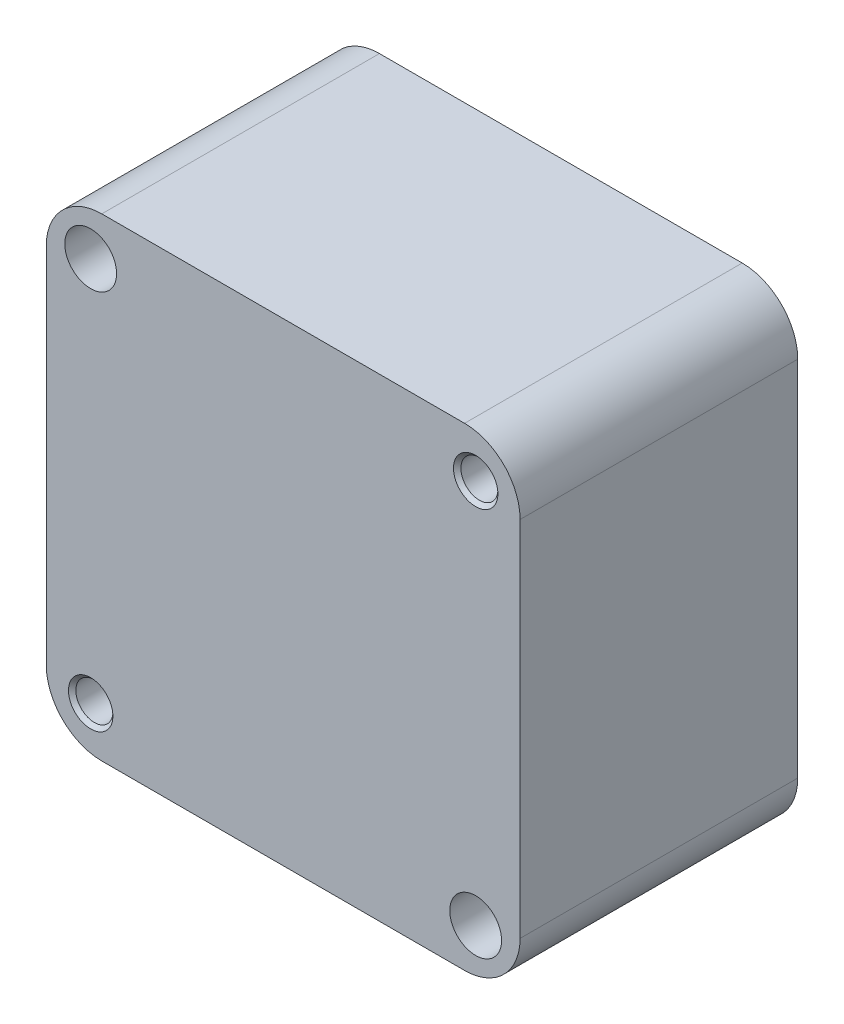
ISO-10303-21;
HEADER;
FILE_DESCRIPTION(('STEP AP214'),'2;1');
FILE_NAME('part.step','',(''),(''),'','','');
FILE_SCHEMA(('AUTOMOTIVE_DESIGN { 1 0 10303 214 1 1 1 1 }'));
ENDSEC;
DATA;
#1=APPLICATION_CONTEXT('core data for automotive mechanical design processes');
#2=APPLICATION_PROTOCOL_DEFINITION('international standard','automotive_design',2000,#1);
#3=PRODUCT_CONTEXT('',#1,'mechanical');
#4=PRODUCT('Part','Part','',(#3));
#5=PRODUCT_RELATED_PRODUCT_CATEGORY('part','',(#4));
#6=PRODUCT_DEFINITION_FORMATION('','',#4);
#7=PRODUCT_DEFINITION_CONTEXT('part definition',#1,'design');
#8=PRODUCT_DEFINITION('design','',#6,#7);
#9=PRODUCT_DEFINITION_SHAPE('','',#8);
#10=(LENGTH_UNIT() NAMED_UNIT(*) SI_UNIT(.MILLI.,.METRE.));
#11=(NAMED_UNIT(*) PLANE_ANGLE_UNIT() SI_UNIT($,.RADIAN.));
#12=(NAMED_UNIT(*) SI_UNIT($,.STERADIAN.) SOLID_ANGLE_UNIT());
#13=UNCERTAINTY_MEASURE_WITH_UNIT(LENGTH_MEASURE(1.E-05),#10,'distance_accuracy_value','');
#14=(GEOMETRIC_REPRESENTATION_CONTEXT(3) GLOBAL_UNCERTAINTY_ASSIGNED_CONTEXT((#13)) GLOBAL_UNIT_ASSIGNED_CONTEXT((#10,
#11,#12)) REPRESENTATION_CONTEXT('',''));
#15=CARTESIAN_POINT('',(0.,0.,0.));
#16=DIRECTION('',(0.,0.,1.));
#17=DIRECTION('',(1.,0.,0.));
#18=AXIS2_PLACEMENT_3D('',#15,#16,#17);
#19=CARTESIAN_POINT('',(52.,52.,17.5000000039063));
#20=DIRECTION('',(0.,0.,1.));
#21=DIRECTION('',(1.,0.,0.));
#22=AXIS2_PLACEMENT_3D('',#19,#20,#21);
#23=CONICAL_SURFACE('',#22,5.00499999767319,1.04719755000224);
#24=CARTESIAN_POINT('',(52.,52.0000000001062,14.6103618999973));
#25=VERTEX_POINT('',#24);
#26=VERTEX_LOOP('',#25);
#27=FACE_BOUND('',#26,.T.);
#28=CARTESIAN_POINT('',(52.,52.,17.5));
#29=DIRECTION('',(0.,0.,1.));
#30=DIRECTION('',(1.,0.,0.));
#31=AXIS2_PLACEMENT_3D('',#28,#29,#30);
#32=CIRCLE('',#31,5.005);
#33=CARTESIAN_POINT('',(57.005,52.,17.5));
#34=VERTEX_POINT('',#33);
#35=EDGE_CURVE('E103',#34,#34,#32,.T.);
#36=ORIENTED_EDGE('',*,*,#35,.T.);
#37=EDGE_LOOP('',(#36));
#38=FACE_BOUND('',#37,.T.);
#39=ADVANCED_FACE('F17',(#27,#38),#23,.F.);
#40=CARTESIAN_POINT('',(-52.,-52.,17.5000000039063));
#41=DIRECTION('',(0.,0.,1.));
#42=DIRECTION('',(1.,0.,0.));
#43=AXIS2_PLACEMENT_3D('',#40,#41,#42);
#44=CONICAL_SURFACE('',#43,5.00499999780189,1.04719754999504);
#45=CARTESIAN_POINT('',(-52.,-51.9999999999925,14.6103618998836));
#46=VERTEX_POINT('',#45);
#47=VERTEX_LOOP('',#46);
#48=FACE_BOUND('',#47,.T.);
#49=CARTESIAN_POINT('',(-52.,-52.,17.5));
#50=DIRECTION('',(0.,0.,1.));
#51=DIRECTION('',(1.,0.,0.));
#52=AXIS2_PLACEMENT_3D('',#49,#50,#51);
#53=CIRCLE('',#52,5.005);
#54=CARTESIAN_POINT('',(-46.995,-52.,17.5));
#55=VERTEX_POINT('',#54);
#56=EDGE_CURVE('E105',#55,#55,#53,.T.);
#57=ORIENTED_EDGE('',*,*,#56,.T.);
#58=EDGE_LOOP('',(#57));
#59=FACE_BOUND('',#58,.T.);
#60=ADVANCED_FACE('F100',(#48,#59),#44,.F.);
#61=CARTESIAN_POINT('',(0.,-44.0000000037912,-22.5));
#62=DIRECTION('',(0.,-1.,0.));
#63=DIRECTION('',(0.,0.,-1.));
#64=AXIS2_PLACEMENT_3D('',#61,#62,#63);
#65=CONICAL_SURFACE('',#64,5.09999999817182,1.13446401246382);
#66=CARTESIAN_POINT('',(0.,-41.6218309399454,-22.5000000002069));
#67=VERTEX_POINT('',#66);
#68=VERTEX_LOOP('',#67);
#69=FACE_BOUND('',#68,.T.);
#70=CARTESIAN_POINT('',(0.,-44.,-22.5));
#71=DIRECTION('',(0.,1.,0.));
#72=DIRECTION('',(0.,0.,1.));
#73=AXIS2_PLACEMENT_3D('',#70,#71,#72);
#74=CIRCLE('',#73,5.1);
#75=CARTESIAN_POINT('',(0.,-44.,-17.4));
#76=VERTEX_POINT('',#75);
#77=EDGE_CURVE('E108',#76,#76,#74,.F.);
#78=ORIENTED_EDGE('',*,*,#77,.T.);
#79=EDGE_LOOP('',(#78));
#80=FACE_BOUND('',#79,.T.);
#81=ADVANCED_FACE('F319',(#69,#80),#65,.F.);
#82=CARTESIAN_POINT('',(52.,52.,17.25));
#83=DIRECTION('',(0.,0.,1.));
#84=DIRECTION('',(1.,0.,0.));
#85=AXIS2_PLACEMENT_3D('',#82,#83,#84);
#86=CYLINDRICAL_SURFACE('',#85,5.005);
#87=ORIENTED_EDGE('',*,*,#35,.F.);
#88=EDGE_LOOP('',(#87));
#89=FACE_BOUND('',#88,.T.);
#90=CARTESIAN_POINT('',(52.,52.,22.5));
#91=DIRECTION('',(0.,0.,1.));
#92=DIRECTION('',(1.,0.,0.));
#93=AXIS2_PLACEMENT_3D('',#90,#91,#92);
#94=CIRCLE('',#93,5.005);
#95=CARTESIAN_POINT('',(57.005,52.,22.5));
#96=VERTEX_POINT('',#95);
#97=EDGE_CURVE('E20',#96,#96,#94,.T.);
#98=ORIENTED_EDGE('',*,*,#97,.T.);
#99=EDGE_LOOP('',(#98));
#100=FACE_BOUND('',#99,.T.);
#101=ADVANCED_FACE('F315',(#89,#100),#86,.F.);
#102=CARTESIAN_POINT('',(-52.,-52.,17.25));
#103=DIRECTION('',(0.,0.,1.));
#104=DIRECTION('',(1.,0.,0.));
#105=AXIS2_PLACEMENT_3D('',#102,#103,#104);
#106=CYLINDRICAL_SURFACE('',#105,5.005);
#107=ORIENTED_EDGE('',*,*,#56,.F.);
#108=EDGE_LOOP('',(#107));
#109=FACE_BOUND('',#108,.T.);
#110=CARTESIAN_POINT('',(-52.,-52.,22.5));
#111=DIRECTION('',(0.,0.,1.));
#112=DIRECTION('',(1.,0.,0.));
#113=AXIS2_PLACEMENT_3D('',#110,#111,#112);
#114=CIRCLE('',#113,5.005);
#115=CARTESIAN_POINT('',(-46.995,-52.,22.5));
#116=VERTEX_POINT('',#115);
#117=EDGE_CURVE('E172',#116,#116,#114,.T.);
#118=ORIENTED_EDGE('',*,*,#117,.T.);
#119=EDGE_LOOP('',(#118));
#120=FACE_BOUND('',#119,.T.);
#121=ADVANCED_FACE('F308',(#109,#120),#106,.F.);
#122=CARTESIAN_POINT('',(0.,-64.,-22.5));
#123=DIRECTION('',(0.,1.,0.));
#124=DIRECTION('',(0.,0.,1.));
#125=AXIS2_PLACEMENT_3D('',#122,#123,#124);
#126=CYLINDRICAL_SURFACE('',#125,5.1);
#127=ORIENTED_EDGE('',*,*,#77,.F.);
#128=EDGE_LOOP('',(#127));
#129=FACE_BOUND('',#128,.T.);
#130=CARTESIAN_POINT('',(0.,-49.,-22.5));
#131=DIRECTION('',(0.,1.,0.));
#132=DIRECTION('',(0.,0.,1.));
#133=AXIS2_PLACEMENT_3D('',#130,#131,#132);
#134=CIRCLE('',#133,5.1);
#135=CARTESIAN_POINT('',(0.,-49.,-17.4));
#136=VERTEX_POINT('',#135);
#137=EDGE_CURVE('E170',#136,#136,#134,.T.);
#138=ORIENTED_EDGE('',*,*,#137,.F.);
#139=EDGE_LOOP('',(#138));
#140=FACE_BOUND('',#139,.T.);
#141=ADVANCED_FACE('F300',(#129,#140),#126,.F.);
#142=CARTESIAN_POINT('',(57.5055,46.4945,22.5));
#143=DIRECTION('',(0.,0.,1.));
#144=DIRECTION('',(1.,0.,0.));
#145=AXIS2_PLACEMENT_3D('',#142,#143,#144);
#146=PLANE('',#145);
#147=CARTESIAN_POINT('',(52.,52.,22.5));
#148=DIRECTION('',(0.,0.,-1.));
#149=DIRECTION('',(-1.,0.,0.));
#150=AXIS2_PLACEMENT_3D('',#147,#148,#149);
#151=CIRCLE('',#150,5.);
#152=CARTESIAN_POINT('',(47.,52.,22.5));
#153=VERTEX_POINT('',#152);
#154=EDGE_CURVE('E167',#153,#153,#151,.F.);
#155=ORIENTED_EDGE('',*,*,#154,.T.);
#156=EDGE_LOOP('',(#155));
#157=FACE_BOUND('',#156,.T.);
#158=ORIENTED_EDGE('',*,*,#97,.F.);
#159=EDGE_LOOP('',(#158));
#160=FACE_BOUND('',#159,.T.);
#161=ADVANCED_FACE('F296',(#157,#160),#146,.F.);
#162=CARTESIAN_POINT('',(-46.4945,-57.5055,22.5));
#163=DIRECTION('',(0.,0.,1.));
#164=DIRECTION('',(1.,0.,0.));
#165=AXIS2_PLACEMENT_3D('',#162,#163,#164);
#166=PLANE('',#165);
#167=CARTESIAN_POINT('',(-52.,-52.,22.5));
#168=DIRECTION('',(0.,0.,-1.));
#169=DIRECTION('',(-1.,0.,0.));
#170=AXIS2_PLACEMENT_3D('',#167,#168,#169);
#171=CIRCLE('',#170,5.);
#172=CARTESIAN_POINT('',(-57.,-52.,22.5));
#173=VERTEX_POINT('',#172);
#174=EDGE_CURVE('E164',#173,#173,#171,.F.);
#175=ORIENTED_EDGE('',*,*,#174,.T.);
#176=EDGE_LOOP('',(#175));
#177=FACE_BOUND('',#176,.T.);
#178=ORIENTED_EDGE('',*,*,#117,.F.);
#179=EDGE_LOOP('',(#178));
#180=FACE_BOUND('',#179,.T.);
#181=ADVANCED_FACE('F299',(#177,#180),#166,.F.);
#182=CARTESIAN_POINT('',(6.60000000000001,-49.,-29.1));
#183=DIRECTION('',(0.,-1.,0.));
#184=DIRECTION('',(0.,0.,-1.));
#185=AXIS2_PLACEMENT_3D('',#182,#183,#184);
#186=PLANE('',#185);
#187=ORIENTED_EDGE('',*,*,#137,.T.);
#188=EDGE_LOOP('',(#187));
#189=FACE_BOUND('',#188,.T.);
#190=CARTESIAN_POINT('',(0.,-49.,-22.5));
#191=DIRECTION('',(0.,1.,0.));
#192=DIRECTION('',(0.,0.,1.));
#193=AXIS2_PLACEMENT_3D('',#190,#191,#192);
#194=CIRCLE('',#193,6.);
#195=CARTESIAN_POINT('',(0.,-49.,-16.5));
#196=VERTEX_POINT('',#195);
#197=EDGE_CURVE('E160',#196,#196,#194,.F.);
#198=ORIENTED_EDGE('',*,*,#197,.T.);
#199=EDGE_LOOP('',(#198));
#200=FACE_BOUND('',#199,.T.);
#201=ADVANCED_FACE('F292',(#189,#200),#186,.T.);
#202=CARTESIAN_POINT('',(52.,52.,37.5));
#203=DIRECTION('',(0.,0.,-1.));
#204=DIRECTION('',(-1.,0.,0.));
#205=AXIS2_PLACEMENT_3D('',#202,#203,#204);
#206=CYLINDRICAL_SURFACE('',#205,5.);
#207=CARTESIAN_POINT('',(52.,52.,36.5000000036275));
#208=DIRECTION('',(0.,0.,1.));
#209=DIRECTION('',(0.,1.,0.));
#210=AXIS2_PLACEMENT_3D('',#207,#208,#209);
#211=CIRCLE('',#210,4.99999999643526);
#212=CARTESIAN_POINT('',(52.,56.9999999964352,36.5000000036275));
#213=VERTEX_POINT('',#212);
#214=EDGE_CURVE('E163',#213,#213,#211,.T.);
#215=ORIENTED_EDGE('',*,*,#214,.T.);
#216=EDGE_LOOP('',(#215));
#217=FACE_BOUND('',#216,.T.);
#218=ORIENTED_EDGE('',*,*,#154,.F.);
#219=EDGE_LOOP('',(#218));
#220=FACE_BOUND('',#219,.T.);
#221=ADVANCED_FACE('F288',(#217,#220),#206,.F.);
#222=CARTESIAN_POINT('',(-52.,-52.,37.5));
#223=DIRECTION('',(0.,0.,-1.));
#224=DIRECTION('',(-1.,0.,0.));
#225=AXIS2_PLACEMENT_3D('',#222,#223,#224);
#226=CYLINDRICAL_SURFACE('',#225,5.);
#227=CARTESIAN_POINT('',(-52.,-52.,36.5000000035707));
#228=DIRECTION('',(0.,0.,1.));
#229=DIRECTION('',(0.,1.,0.));
#230=AXIS2_PLACEMENT_3D('',#227,#228,#229);
#231=CIRCLE('',#230,4.99999999639342);
#232=CARTESIAN_POINT('',(-52.,-47.0000000036066,36.5000000035707));
#233=VERTEX_POINT('',#232);
#234=EDGE_CURVE('E185',#233,#233,#231,.T.);
#235=ORIENTED_EDGE('',*,*,#234,.T.);
#236=EDGE_LOOP('',(#235));
#237=FACE_BOUND('',#236,.T.);
#238=ORIENTED_EDGE('',*,*,#174,.F.);
#239=EDGE_LOOP('',(#238));
#240=FACE_BOUND('',#239,.T.);
#241=ADVANCED_FACE('F291',(#237,#240),#226,.F.);
#242=CARTESIAN_POINT('',(0.,-64.,-22.5));
#243=DIRECTION('',(0.,1.,0.));
#244=DIRECTION('',(0.,0.,1.));
#245=AXIS2_PLACEMENT_3D('',#242,#243,#244);
#246=CYLINDRICAL_SURFACE('',#245,6.);
#247=CARTESIAN_POINT('',(0.,-62.5000000044906,-22.5));
#248=DIRECTION('',(0.,-1.,0.));
#249=DIRECTION('',(0.,0.,1.));
#250=AXIS2_PLACEMENT_3D('',#247,#248,#249);
#251=CIRCLE('',#250,5.99999999550164);
#252=CARTESIAN_POINT('',(0.,-62.5000000044906,-16.5000000044984));
#253=VERTEX_POINT('',#252);
#254=EDGE_CURVE('E159',#253,#253,#251,.T.);
#255=ORIENTED_EDGE('',*,*,#254,.T.);
#256=EDGE_LOOP('',(#255));
#257=FACE_BOUND('',#256,.T.);
#258=ORIENTED_EDGE('',*,*,#197,.F.);
#259=EDGE_LOOP('',(#258));
#260=FACE_BOUND('',#259,.T.);
#261=ADVANCED_FACE('F284',(#257,#260),#246,.F.);
#262=CARTESIAN_POINT('',(52.,52.,37.5000000044565));
#263=DIRECTION('',(0.,0.,1.));
#264=DIRECTION('',(1.,0.,0.));
#265=AXIS2_PLACEMENT_3D('',#262,#263,#264);
#266=CONICAL_SURFACE('',#265,5.99999999544527,0.785398162487954);
#267=CARTESIAN_POINT('',(52.,52.,37.5000000044565));
#268=DIRECTION('',(0.,0.,1.));
#269=DIRECTION('',(1.,0.,0.));
#270=AXIS2_PLACEMENT_3D('',#267,#268,#269);
#271=CIRCLE('',#270,5.99999999544527);
#272=CARTESIAN_POINT('',(57.9999999954453,52.,37.5000000044565));
#273=VERTEX_POINT('',#272);
#274=EDGE_CURVE('E156',#273,#273,#271,.F.);
#275=ORIENTED_EDGE('',*,*,#274,.F.);
#276=EDGE_LOOP('',(#275));
#277=FACE_BOUND('',#276,.T.);
#278=ORIENTED_EDGE('',*,*,#214,.F.);
#279=EDGE_LOOP('',(#278));
#280=FACE_BOUND('',#279,.T.);
#281=ADVANCED_FACE('F280',(#277,#280),#266,.F.);
#282=CARTESIAN_POINT('',(-52.,-52.,37.5000000045134));
#283=DIRECTION('',(0.,0.,1.));
#284=DIRECTION('',(1.,0.,0.));
#285=AXIS2_PLACEMENT_3D('',#282,#283,#284);
#286=CONICAL_SURFACE('',#285,5.99999999551713,0.785398162487954);
#287=CARTESIAN_POINT('',(-52.,-52.,37.5000000045134));
#288=DIRECTION('',(0.,0.,1.));
#289=DIRECTION('',(1.,0.,0.));
#290=AXIS2_PLACEMENT_3D('',#287,#288,#289);
#291=CIRCLE('',#290,5.99999999551713);
#292=CARTESIAN_POINT('',(-46.0000000044828,-52.,37.5000000045134));
#293=VERTEX_POINT('',#292);
#294=EDGE_CURVE('E153',#293,#293,#291,.F.);
#295=ORIENTED_EDGE('',*,*,#294,.F.);
#296=EDGE_LOOP('',(#295));
#297=FACE_BOUND('',#296,.T.);
#298=ORIENTED_EDGE('',*,*,#234,.F.);
#299=EDGE_LOOP('',(#298));
#300=FACE_BOUND('',#299,.T.);
#301=ADVANCED_FACE('F283',(#297,#300),#286,.F.);
#302=CARTESIAN_POINT('',(0.,-64.0000000058194,-22.5));
#303=DIRECTION('',(0.,-1.,0.));
#304=DIRECTION('',(0.,0.,-1.));
#305=AXIS2_PLACEMENT_3D('',#302,#303,#304);
#306=CONICAL_SURFACE('',#305,7.49999999415877,0.785398162506901);
#307=CARTESIAN_POINT('',(0.,-64.0000000058194,-22.5));
#308=DIRECTION('',(0.,-1.,0.));
#309=DIRECTION('',(0.,0.,-1.));
#310=AXIS2_PLACEMENT_3D('',#307,#308,#309);
#311=CIRCLE('',#310,7.49999999415877);
#312=CARTESIAN_POINT('',(0.,-64.0000000058194,-29.9999999941588));
#313=VERTEX_POINT('',#312);
#314=EDGE_CURVE('E149',#313,#313,#311,.F.);
#315=ORIENTED_EDGE('',*,*,#314,.F.);
#316=EDGE_LOOP('',(#315));
#317=FACE_BOUND('',#316,.T.);
#318=ORIENTED_EDGE('',*,*,#254,.F.);
#319=EDGE_LOOP('',(#318));
#320=FACE_BOUND('',#319,.T.);
#321=ADVANCED_FACE('F271',(#317,#320),#306,.F.);
#322=CARTESIAN_POINT('',(-70.4,-70.4,37.5));
#323=DIRECTION('',(0.,0.,1.));
#324=DIRECTION('',(1.,0.,0.));
#325=AXIS2_PLACEMENT_3D('',#322,#323,#324);
#326=PLANE('',#325);
#327=CARTESIAN_POINT('',(-52.,52.,37.5));
#328=DIRECTION('',(0.,0.,-1.));
#329=DIRECTION('',(-1.,0.,0.));
#330=AXIS2_PLACEMENT_3D('',#327,#328,#329);
#331=CIRCLE('',#330,7.);
#332=CARTESIAN_POINT('',(-59.,52.,37.5));
#333=VERTEX_POINT('',#332);
#334=EDGE_CURVE('E129',#333,#333,#331,.T.);
#335=ORIENTED_EDGE('',*,*,#334,.T.);
#336=EDGE_LOOP('',(#335));
#337=FACE_BOUND('',#336,.T.);
#338=CARTESIAN_POINT('',(52.,-52.,37.5));
#339=DIRECTION('',(0.,0.,-1.));
#340=DIRECTION('',(-1.,0.,0.));
#341=AXIS2_PLACEMENT_3D('',#338,#339,#340);
#342=CIRCLE('',#341,7.);
#343=CARTESIAN_POINT('',(45.,-52.,37.5));
#344=VERTEX_POINT('',#343);
#345=EDGE_CURVE('E132',#344,#344,#342,.T.);
#346=ORIENTED_EDGE('',*,*,#345,.T.);
#347=EDGE_LOOP('',(#346));
#348=FACE_BOUND('',#347,.T.);
#349=ORIENTED_EDGE('',*,*,#294,.T.);
#350=EDGE_LOOP('',(#349));
#351=FACE_BOUND('',#350,.T.);
#352=ORIENTED_EDGE('',*,*,#274,.T.);
#353=EDGE_LOOP('',(#352));
#354=FACE_BOUND('',#353,.T.);
#355=DIRECTION('',(1.,0.,0.));
#356=VECTOR('',#355,1.);
#357=CARTESIAN_POINT('',(-53.9,64.,37.5));
#358=LINE('',#357,#356);
#359=CARTESIAN_POINT('',(-49.,64.,37.5));
#360=VERTEX_POINT('',#359);
#361=CARTESIAN_POINT('',(49.,64.,37.5));
#362=VERTEX_POINT('',#361);
#363=EDGE_CURVE('E191',#360,#362,#358,.T.);
#364=ORIENTED_EDGE('',*,*,#363,.F.);
#365=CARTESIAN_POINT('',(-49.,49.,37.5));
#366=DIRECTION('',(0.,0.,1.));
#367=DIRECTION('',(1.,0.,0.));
#368=AXIS2_PLACEMENT_3D('',#365,#366,#367);
#369=CIRCLE('',#368,15.);
#370=CARTESIAN_POINT('',(-64.,49.,37.5));
#371=VERTEX_POINT('',#370);
#372=EDGE_CURVE('E139',#371,#360,#369,.F.);
#373=ORIENTED_EDGE('',*,*,#372,.F.);
#374=DIRECTION('',(0.,1.,0.));
#375=VECTOR('',#374,1.);
#376=CARTESIAN_POINT('',(-64.,-53.9,37.5));
#377=LINE('',#376,#375);
#378=CARTESIAN_POINT('',(-64.,-49.,37.5));
#379=VERTEX_POINT('',#378);
#380=EDGE_CURVE('E193',#379,#371,#377,.T.);
#381=ORIENTED_EDGE('',*,*,#380,.F.);
#382=CARTESIAN_POINT('',(-49.,-49.,37.5));
#383=DIRECTION('',(0.,0.,1.));
#384=DIRECTION('',(1.,0.,0.));
#385=AXIS2_PLACEMENT_3D('',#382,#383,#384);
#386=CIRCLE('',#385,15.);
#387=CARTESIAN_POINT('',(-49.,-64.,37.5));
#388=VERTEX_POINT('',#387);
#389=EDGE_CURVE('E136',#388,#379,#386,.F.);
#390=ORIENTED_EDGE('',*,*,#389,.F.);
#391=DIRECTION('',(1.,0.,0.));
#392=VECTOR('',#391,1.);
#393=CARTESIAN_POINT('',(-53.9,-64.,37.5));
#394=LINE('',#393,#392);
#395=CARTESIAN_POINT('',(49.,-64.,37.5));
#396=VERTEX_POINT('',#395);
#397=EDGE_CURVE('E152',#396,#388,#394,.F.);
#398=ORIENTED_EDGE('',*,*,#397,.F.);
#399=CARTESIAN_POINT('',(49.,-49.,37.5));
#400=DIRECTION('',(0.,0.,1.));
#401=DIRECTION('',(1.,0.,0.));
#402=AXIS2_PLACEMENT_3D('',#399,#400,#401);
#403=CIRCLE('',#402,15.);
#404=CARTESIAN_POINT('',(64.,-49.,37.5));
#405=VERTEX_POINT('',#404);
#406=EDGE_CURVE('E88',#405,#396,#403,.F.);
#407=ORIENTED_EDGE('',*,*,#406,.F.);
#408=DIRECTION('',(0.,1.,0.));
#409=VECTOR('',#408,1.);
#410=CARTESIAN_POINT('',(64.,-53.9,37.5));
#411=LINE('',#410,#409);
#412=CARTESIAN_POINT('',(64.,49.,37.5));
#413=VERTEX_POINT('',#412);
#414=EDGE_CURVE('E82',#413,#405,#411,.F.);
#415=ORIENTED_EDGE('',*,*,#414,.F.);
#416=CARTESIAN_POINT('',(49.,49.,37.5));
#417=DIRECTION('',(0.,0.,1.));
#418=DIRECTION('',(1.,0.,0.));
#419=AXIS2_PLACEMENT_3D('',#416,#417,#418);
#420=CIRCLE('',#419,15.);
#421=EDGE_CURVE('E143',#362,#413,#420,.F.);
#422=ORIENTED_EDGE('',*,*,#421,.F.);
#423=EDGE_LOOP('',(#364,#373,#381,#390,#398,#407,#415,#422));
#424=FACE_BOUND('',#423,.T.);
#425=ADVANCED_FACE('F268',(#337,#348,#351,#354,#424),#326,.T.);
#426=CARTESIAN_POINT('',(-53.9,-64.,41.25));
#427=DIRECTION('',(0.,-1.,0.));
#428=DIRECTION('',(0.,0.,-1.));
#429=AXIS2_PLACEMENT_3D('',#426,#427,#428);
#430=PLANE('',#429);
#431=ORIENTED_EDGE('',*,*,#314,.T.);
#432=EDGE_LOOP('',(#431));
#433=FACE_BOUND('',#432,.T.);
#434=DIRECTION('',(1.,0.,0.));
#435=VECTOR('',#434,1.);
#436=CARTESIAN_POINT('',(-70.4,-64.,-37.5));
#437=LINE('',#436,#435);
#438=CARTESIAN_POINT('',(-49.,-64.,-37.5));
#439=VERTEX_POINT('',#438);
#440=CARTESIAN_POINT('',(49.,-64.,-37.5));
#441=VERTEX_POINT('',#440);
#442=EDGE_CURVE('E128',#439,#441,#437,.T.);
#443=ORIENTED_EDGE('',*,*,#442,.T.);
#444=DIRECTION('',(0.,0.,1.));
#445=VECTOR('',#444,1.);
#446=CARTESIAN_POINT('',(49.,-64.,-41.25));
#447=LINE('',#446,#445);
#448=EDGE_CURVE('E148',#396,#441,#447,.F.);
#449=ORIENTED_EDGE('',*,*,#448,.F.);
#450=ORIENTED_EDGE('',*,*,#397,.T.);
#451=DIRECTION('',(0.,0.,1.));
#452=VECTOR('',#451,1.);
#453=CARTESIAN_POINT('',(-49.,-64.,-41.25));
#454=LINE('',#453,#452);
#455=EDGE_CURVE('E135',#439,#388,#454,.T.);
#456=ORIENTED_EDGE('',*,*,#455,.F.);
#457=EDGE_LOOP('',(#443,#449,#450,#456));
#458=FACE_BOUND('',#457,.T.);
#459=ADVANCED_FACE('F238',(#433,#458),#430,.T.);
#460=CARTESIAN_POINT('',(49.,-49.,-41.25));
#461=DIRECTION('',(0.,0.,1.));
#462=DIRECTION('',(1.,0.,0.));
#463=AXIS2_PLACEMENT_3D('',#460,#461,#462);
#464=CYLINDRICAL_SURFACE('',#463,15.);
#465=CARTESIAN_POINT('',(49.,-49.,-37.5));
#466=DIRECTION('',(0.,0.,1.));
#467=DIRECTION('',(1.,0.,0.));
#468=AXIS2_PLACEMENT_3D('',#465,#466,#467);
#469=CIRCLE('',#468,15.);
#470=CARTESIAN_POINT('',(64.,-49.,-37.5));
#471=VERTEX_POINT('',#470);
#472=EDGE_CURVE('E125',#441,#471,#469,.T.);
#473=ORIENTED_EDGE('',*,*,#472,.T.);
#474=DIRECTION('',(0.,0.,-1.));
#475=VECTOR('',#474,1.);
#476=CARTESIAN_POINT('',(64.,-49.,41.25));
#477=LINE('',#476,#475);
#478=EDGE_CURVE('E146',#405,#471,#477,.T.);
#479=ORIENTED_EDGE('',*,*,#478,.F.);
#480=ORIENTED_EDGE('',*,*,#406,.T.);
#481=ORIENTED_EDGE('',*,*,#448,.T.);
#482=EDGE_LOOP('',(#473,#479,#480,#481));
#483=FACE_BOUND('',#482,.T.);
#484=ADVANCED_FACE('F235',(#483),#464,.T.);
#485=CARTESIAN_POINT('',(64.,-53.9,41.25));
#486=DIRECTION('',(1.,0.,0.));
#487=DIRECTION('',(0.,0.,-1.));
#488=AXIS2_PLACEMENT_3D('',#485,#486,#487);
#489=PLANE('',#488);
#490=DIRECTION('',(0.,1.,0.));
#491=VECTOR('',#490,1.);
#492=CARTESIAN_POINT('',(64.,-70.4,-37.5));
#493=LINE('',#492,#491);
#494=CARTESIAN_POINT('',(64.,49.,-37.5));
#495=VERTEX_POINT('',#494);
#496=EDGE_CURVE('E124',#471,#495,#493,.T.);
#497=ORIENTED_EDGE('',*,*,#496,.T.);
#498=DIRECTION('',(0.,0.,1.));
#499=VECTOR('',#498,1.);
#500=CARTESIAN_POINT('',(64.,49.,-41.25));
#501=LINE('',#500,#499);
#502=EDGE_CURVE('E145',#413,#495,#501,.F.);
#503=ORIENTED_EDGE('',*,*,#502,.F.);
#504=ORIENTED_EDGE('',*,*,#414,.T.);
#505=ORIENTED_EDGE('',*,*,#478,.T.);
#506=EDGE_LOOP('',(#497,#503,#504,#505));
#507=FACE_BOUND('',#506,.T.);
#508=ADVANCED_FACE('F233',(#507),#489,.T.);
#509=CARTESIAN_POINT('',(49.,49.,-41.25));
#510=DIRECTION('',(0.,0.,1.));
#511=DIRECTION('',(1.,0.,0.));
#512=AXIS2_PLACEMENT_3D('',#509,#510,#511);
#513=CYLINDRICAL_SURFACE('',#512,15.);
#514=CARTESIAN_POINT('',(49.,49.,-37.5));
#515=DIRECTION('',(0.,0.,1.));
#516=DIRECTION('',(1.,0.,0.));
#517=AXIS2_PLACEMENT_3D('',#514,#515,#516);
#518=CIRCLE('',#517,15.);
#519=CARTESIAN_POINT('',(49.,64.,-37.5));
#520=VERTEX_POINT('',#519);
#521=EDGE_CURVE('E121',#495,#520,#518,.T.);
#522=ORIENTED_EDGE('',*,*,#521,.T.);
#523=DIRECTION('',(0.,0.,1.));
#524=VECTOR('',#523,1.);
#525=CARTESIAN_POINT('',(49.,64.,-41.25));
#526=LINE('',#525,#524);
#527=EDGE_CURVE('E142',#362,#520,#526,.F.);
#528=ORIENTED_EDGE('',*,*,#527,.F.);
#529=ORIENTED_EDGE('',*,*,#421,.T.);
#530=ORIENTED_EDGE('',*,*,#502,.T.);
#531=EDGE_LOOP('',(#522,#528,#529,#530));
#532=FACE_BOUND('',#531,.T.);
#533=ADVANCED_FACE('F232',(#532),#513,.T.);
#534=CARTESIAN_POINT('',(-53.9,64.,-41.25));
#535=DIRECTION('',(0.,1.,0.));
#536=DIRECTION('',(0.,0.,1.));
#537=AXIS2_PLACEMENT_3D('',#534,#535,#536);
#538=PLANE('',#537);
#539=DIRECTION('',(1.,0.,0.));
#540=VECTOR('',#539,1.);
#541=CARTESIAN_POINT('',(-70.4,64.,-37.5));
#542=LINE('',#541,#540);
#543=CARTESIAN_POINT('',(-49.,64.,-37.5));
#544=VERTEX_POINT('',#543);
#545=EDGE_CURVE('E120',#520,#544,#542,.F.);
#546=ORIENTED_EDGE('',*,*,#545,.T.);
#547=DIRECTION('',(0.,0.,1.));
#548=VECTOR('',#547,1.);
#549=CARTESIAN_POINT('',(-49.,64.,-41.25));
#550=LINE('',#549,#548);
#551=EDGE_CURVE('E141',#360,#544,#550,.F.);
#552=ORIENTED_EDGE('',*,*,#551,.F.);
#553=ORIENTED_EDGE('',*,*,#363,.T.);
#554=ORIENTED_EDGE('',*,*,#527,.T.);
#555=EDGE_LOOP('',(#546,#552,#553,#554));
#556=FACE_BOUND('',#555,.T.);
#557=ADVANCED_FACE('F226',(#556),#538,.T.);
#558=CARTESIAN_POINT('',(-49.,49.,-41.25));
#559=DIRECTION('',(0.,0.,1.));
#560=DIRECTION('',(1.,0.,0.));
#561=AXIS2_PLACEMENT_3D('',#558,#559,#560);
#562=CYLINDRICAL_SURFACE('',#561,15.);
#563=CARTESIAN_POINT('',(-49.,49.,-37.5));
#564=DIRECTION('',(0.,0.,1.));
#565=DIRECTION('',(1.,0.,0.));
#566=AXIS2_PLACEMENT_3D('',#563,#564,#565);
#567=CIRCLE('',#566,15.);
#568=CARTESIAN_POINT('',(-64.,49.,-37.5));
#569=VERTEX_POINT('',#568);
#570=EDGE_CURVE('E117',#544,#569,#567,.T.);
#571=ORIENTED_EDGE('',*,*,#570,.T.);
#572=DIRECTION('',(0.,0.,1.));
#573=VECTOR('',#572,1.);
#574=CARTESIAN_POINT('',(-64.,49.,-41.25));
#575=LINE('',#574,#573);
#576=EDGE_CURVE('E138',#371,#569,#575,.F.);
#577=ORIENTED_EDGE('',*,*,#576,.F.);
#578=ORIENTED_EDGE('',*,*,#372,.T.);
#579=ORIENTED_EDGE('',*,*,#551,.T.);
#580=EDGE_LOOP('',(#571,#577,#578,#579));
#581=FACE_BOUND('',#580,.T.);
#582=ADVANCED_FACE('F221',(#581),#562,.T.);
#583=CARTESIAN_POINT('',(-64.,-53.9,-41.25));
#584=DIRECTION('',(-1.,0.,0.));
#585=DIRECTION('',(0.,0.,1.));
#586=AXIS2_PLACEMENT_3D('',#583,#584,#585);
#587=PLANE('',#586);
#588=DIRECTION('',(0.,1.,0.));
#589=VECTOR('',#588,1.);
#590=CARTESIAN_POINT('',(-64.,-70.4,-37.5));
#591=LINE('',#590,#589);
#592=CARTESIAN_POINT('',(-64.,-49.,-37.5));
#593=VERTEX_POINT('',#592);
#594=EDGE_CURVE('E116',#569,#593,#591,.F.);
#595=ORIENTED_EDGE('',*,*,#594,.T.);
#596=DIRECTION('',(0.,0.,1.));
#597=VECTOR('',#596,1.);
#598=CARTESIAN_POINT('',(-64.,-49.,-41.25));
#599=LINE('',#598,#597);
#600=EDGE_CURVE('E35',#379,#593,#599,.F.);
#601=ORIENTED_EDGE('',*,*,#600,.F.);
#602=ORIENTED_EDGE('',*,*,#380,.T.);
#603=ORIENTED_EDGE('',*,*,#576,.T.);
#604=EDGE_LOOP('',(#595,#601,#602,#603));
#605=FACE_BOUND('',#604,.T.);
#606=ADVANCED_FACE('F214',(#605),#587,.T.);
#607=CARTESIAN_POINT('',(-49.,-49.,-41.25));
#608=DIRECTION('',(0.,0.,1.));
#609=DIRECTION('',(1.,0.,0.));
#610=AXIS2_PLACEMENT_3D('',#607,#608,#609);
#611=CYLINDRICAL_SURFACE('',#610,15.);
#612=CARTESIAN_POINT('',(-49.,-49.,-37.5));
#613=DIRECTION('',(0.,0.,1.));
#614=DIRECTION('',(1.,0.,0.));
#615=AXIS2_PLACEMENT_3D('',#612,#613,#614);
#616=CIRCLE('',#615,15.);
#617=EDGE_CURVE('E114',#593,#439,#616,.T.);
#618=ORIENTED_EDGE('',*,*,#617,.T.);
#619=ORIENTED_EDGE('',*,*,#455,.T.);
#620=ORIENTED_EDGE('',*,*,#389,.T.);
#621=ORIENTED_EDGE('',*,*,#600,.T.);
#622=EDGE_LOOP('',(#618,#619,#620,#621));
#623=FACE_BOUND('',#622,.T.);
#624=ADVANCED_FACE('F241',(#623),#611,.T.);
#625=CARTESIAN_POINT('',(52.,-52.,41.25));
#626=DIRECTION('',(0.,0.,-1.));
#627=DIRECTION('',(-1.,0.,0.));
#628=AXIS2_PLACEMENT_3D('',#625,#626,#627);
#629=CYLINDRICAL_SURFACE('',#628,7.);
#630=CARTESIAN_POINT('',(52.,-52.,-37.5));
#631=DIRECTION('',(0.,0.,-1.));
#632=DIRECTION('',(-1.,0.,0.));
#633=AXIS2_PLACEMENT_3D('',#630,#631,#632);
#634=CIRCLE('',#633,7.);
#635=CARTESIAN_POINT('',(45.,-52.,-37.5));
#636=VERTEX_POINT('',#635);
#637=EDGE_CURVE('E26',#636,#636,#634,.T.);
#638=ORIENTED_EDGE('',*,*,#637,.T.);
#639=EDGE_LOOP('',(#638));
#640=FACE_BOUND('',#639,.T.);
#641=ORIENTED_EDGE('',*,*,#345,.F.);
#642=EDGE_LOOP('',(#641));
#643=FACE_BOUND('',#642,.T.);
#644=ADVANCED_FACE('F243',(#640,#643),#629,.F.);
#645=CARTESIAN_POINT('',(-52.,52.,41.25));
#646=DIRECTION('',(0.,0.,-1.));
#647=DIRECTION('',(-1.,0.,0.));
#648=AXIS2_PLACEMENT_3D('',#645,#646,#647);
#649=CYLINDRICAL_SURFACE('',#648,7.);
#650=CARTESIAN_POINT('',(-52.,52.,-37.5));
#651=DIRECTION('',(0.,0.,-1.));
#652=DIRECTION('',(-1.,0.,0.));
#653=AXIS2_PLACEMENT_3D('',#650,#651,#652);
#654=CIRCLE('',#653,7.);
#655=CARTESIAN_POINT('',(-59.,52.,-37.5));
#656=VERTEX_POINT('',#655);
#657=EDGE_CURVE('E11',#656,#656,#654,.T.);
#658=ORIENTED_EDGE('',*,*,#657,.T.);
#659=EDGE_LOOP('',(#658));
#660=FACE_BOUND('',#659,.T.);
#661=ORIENTED_EDGE('',*,*,#334,.F.);
#662=EDGE_LOOP('',(#661));
#663=FACE_BOUND('',#662,.T.);
#664=ADVANCED_FACE('F250',(#660,#663),#649,.F.);
#665=CARTESIAN_POINT('',(-70.4,-70.4,-37.5));
#666=DIRECTION('',(0.,0.,1.));
#667=DIRECTION('',(1.,0.,0.));
#668=AXIS2_PLACEMENT_3D('',#665,#666,#667);
#669=PLANE('',#668);
#670=ORIENTED_EDGE('',*,*,#657,.F.);
#671=EDGE_LOOP('',(#670));
#672=FACE_BOUND('',#671,.T.);
#673=ORIENTED_EDGE('',*,*,#637,.F.);
#674=EDGE_LOOP('',(#673));
#675=FACE_BOUND('',#674,.T.);
#676=ORIENTED_EDGE('',*,*,#594,.F.);
#677=ORIENTED_EDGE('',*,*,#570,.F.);
#678=ORIENTED_EDGE('',*,*,#545,.F.);
#679=ORIENTED_EDGE('',*,*,#521,.F.);
#680=ORIENTED_EDGE('',*,*,#496,.F.);
#681=ORIENTED_EDGE('',*,*,#472,.F.);
#682=ORIENTED_EDGE('',*,*,#442,.F.);
#683=ORIENTED_EDGE('',*,*,#617,.F.);
#684=EDGE_LOOP('',(#676,#677,#678,#679,#680,#681,#682,#683));
#685=FACE_BOUND('',#684,.T.);
#686=ADVANCED_FACE('F218',(#672,#675,#685),#669,.F.);
#687=CLOSED_SHELL('',(#39,#60,#81,#101,#121,#141,#161,#181,#201,#221,#241,#261,#281,#301,#321,
#425,#459,#484,#508,#533,#557,#582,#606,#624,#644,#664,#686));
#688=MANIFOLD_SOLID_BREP('B1',#687);
#689=ADVANCED_BREP_SHAPE_REPRESENTATION('',(#18,#688),#14);
#690=SHAPE_DEFINITION_REPRESENTATION(#9,#689);
ENDSEC;
END-ISO-10303-21;
